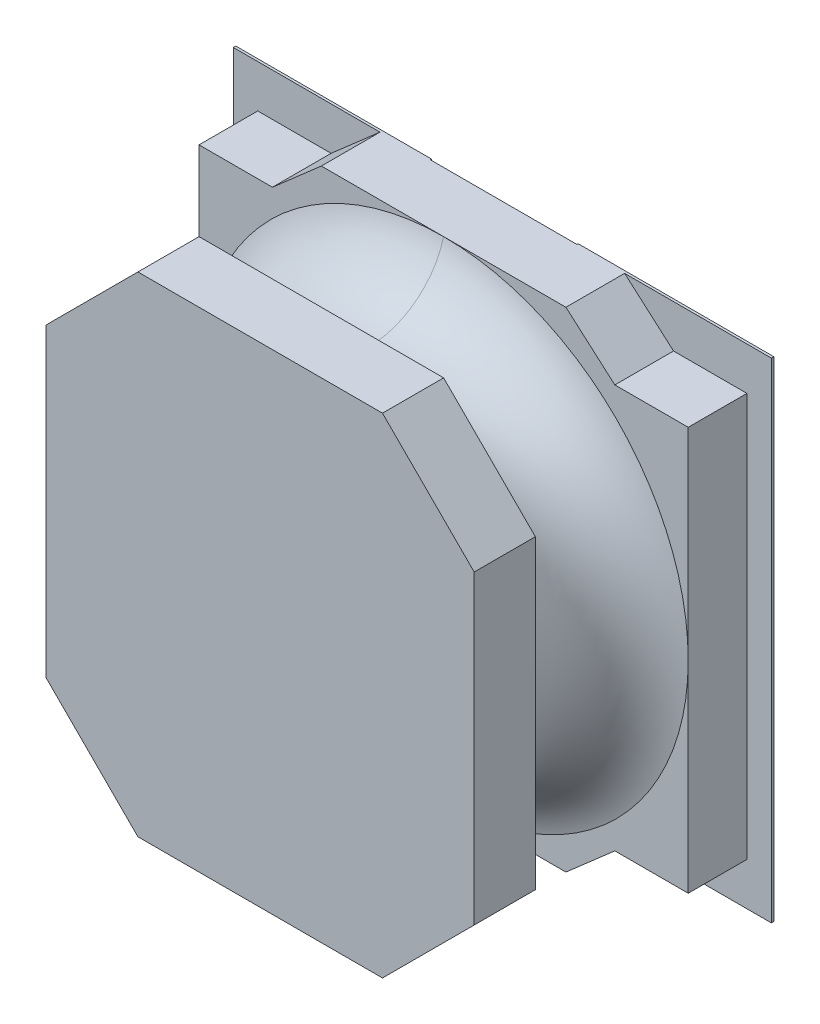
ISO-10303-21;
HEADER;
FILE_DESCRIPTION(('STEP AP214'),'2;1');
FILE_NAME('part.step','',(''),(''),'','','');
FILE_SCHEMA(('AUTOMOTIVE_DESIGN { 1 0 10303 214 1 1 1 1 }'));
ENDSEC;
DATA;
#1=APPLICATION_CONTEXT('core data for automotive mechanical design processes');
#2=APPLICATION_PROTOCOL_DEFINITION('international standard','automotive_design',2000,#1);
#3=PRODUCT_CONTEXT('',#1,'mechanical');
#4=PRODUCT('Part','Part','',(#3));
#5=PRODUCT_RELATED_PRODUCT_CATEGORY('part','',(#4));
#6=PRODUCT_DEFINITION_FORMATION('','',#4);
#7=PRODUCT_DEFINITION_CONTEXT('part definition',#1,'design');
#8=PRODUCT_DEFINITION('design','',#6,#7);
#9=PRODUCT_DEFINITION_SHAPE('','',#8);
#10=(LENGTH_UNIT() NAMED_UNIT(*) SI_UNIT(.MILLI.,.METRE.));
#11=(NAMED_UNIT(*) PLANE_ANGLE_UNIT() SI_UNIT($,.RADIAN.));
#12=(NAMED_UNIT(*) SI_UNIT($,.STERADIAN.) SOLID_ANGLE_UNIT());
#13=UNCERTAINTY_MEASURE_WITH_UNIT(LENGTH_MEASURE(1.E-05),#10,'distance_accuracy_value','');
#14=(GEOMETRIC_REPRESENTATION_CONTEXT(3) GLOBAL_UNCERTAINTY_ASSIGNED_CONTEXT((#13)) GLOBAL_UNIT_ASSIGNED_CONTEXT((#10,
#11,#12)) REPRESENTATION_CONTEXT('',''));
#15=CARTESIAN_POINT('',(0.,0.,0.));
#16=DIRECTION('',(0.,0.,1.));
#17=DIRECTION('',(1.,0.,0.));
#18=AXIS2_PLACEMENT_3D('',#15,#16,#17);
#19=CARTESIAN_POINT('',(-0.6,-2.,0.0762));
#20=DIRECTION('',(1.,0.,0.));
#21=DIRECTION('',(0.,1.,0.));
#22=AXIS2_PLACEMENT_3D('',#19,#20,#21);
#23=PLANE('',#22);
#24=DIRECTION('',(0.,1.,0.));
#25=VECTOR('',#24,1.);
#26=CARTESIAN_POINT('',(-0.6,-2.,0.0762));
#27=LINE('',#26,#25);
#28=CARTESIAN_POINT('',(-0.6,-2.,0.0762));
#29=VERTEX_POINT('',#28);
#30=CARTESIAN_POINT('',(-0.6,2.,0.0762));
#31=VERTEX_POINT('',#30);
#32=EDGE_CURVE('E28',#29,#31,#27,.T.);
#33=ORIENTED_EDGE('',*,*,#32,.T.);
#34=DIRECTION('',(0.,0.,1.));
#35=VECTOR('',#34,1.);
#36=CARTESIAN_POINT('',(-0.6,2.,0.0762));
#37=LINE('',#36,#35);
#38=CARTESIAN_POINT('',(-0.6,2.,0.0862));
#39=VERTEX_POINT('',#38);
#40=EDGE_CURVE('E404',#31,#39,#37,.T.);
#41=ORIENTED_EDGE('',*,*,#40,.T.);
#42=DIRECTION('',(0.,-1.,0.));
#43=VECTOR('',#42,1.);
#44=CARTESIAN_POINT('',(-0.6,2.,0.0862));
#45=LINE('',#44,#43);
#46=CARTESIAN_POINT('',(-0.6,-2.,0.0862));
#47=VERTEX_POINT('',#46);
#48=EDGE_CURVE('E322',#39,#47,#45,.T.);
#49=ORIENTED_EDGE('',*,*,#48,.T.);
#50=DIRECTION('',(0.,0.,1.));
#51=VECTOR('',#50,1.);
#52=CARTESIAN_POINT('',(-0.6,-2.,0.0762));
#53=LINE('',#52,#51);
#54=EDGE_CURVE('E358',#29,#47,#53,.T.);
#55=ORIENTED_EDGE('',*,*,#54,.F.);
#56=EDGE_LOOP('',(#33,#41,#49,#55));
#57=FACE_BOUND('',#56,.T.);
#58=ADVANCED_FACE('F17',(#57),#23,.T.);
#59=CARTESIAN_POINT('',(-2.2,2.,0.0762));
#60=DIRECTION('',(-1.,0.,0.));
#61=DIRECTION('',(0.,0.,1.));
#62=AXIS2_PLACEMENT_3D('',#59,#60,#61);
#63=PLANE('',#62);
#64=DIRECTION('',(0.,0.,1.));
#65=VECTOR('',#64,1.);
#66=CARTESIAN_POINT('',(-2.2,-2.,0.0762));
#67=LINE('',#66,#65);
#68=CARTESIAN_POINT('',(-2.2,-2.,0.0762));
#69=VERTEX_POINT('',#68);
#70=CARTESIAN_POINT('',(-2.2,-2.,0.0962));
#71=VERTEX_POINT('',#70);
#72=EDGE_CURVE('E374',#69,#71,#67,.T.);
#73=ORIENTED_EDGE('',*,*,#72,.T.);
#74=DIRECTION('',(0.,-1.,0.));
#75=VECTOR('',#74,1.);
#76=CARTESIAN_POINT('',(-2.2,2.,0.0962));
#77=LINE('',#76,#75);
#78=CARTESIAN_POINT('',(-2.2,2.,0.0962));
#79=VERTEX_POINT('',#78);
#80=EDGE_CURVE('E572',#79,#71,#77,.T.);
#81=ORIENTED_EDGE('',*,*,#80,.F.);
#82=DIRECTION('',(0.,0.,1.));
#83=VECTOR('',#82,1.);
#84=CARTESIAN_POINT('',(-2.2,2.,0.0762));
#85=LINE('',#84,#83);
#86=CARTESIAN_POINT('',(-2.2,2.,0.0762));
#87=VERTEX_POINT('',#86);
#88=EDGE_CURVE('E403',#87,#79,#85,.T.);
#89=ORIENTED_EDGE('',*,*,#88,.F.);
#90=DIRECTION('',(0.,-1.,0.));
#91=VECTOR('',#90,1.);
#92=CARTESIAN_POINT('',(-2.2,2.,0.0762));
#93=LINE('',#92,#91);
#94=EDGE_CURVE('E11',#87,#69,#93,.T.);
#95=ORIENTED_EDGE('',*,*,#94,.T.);
#96=EDGE_LOOP('',(#73,#81,#89,#95));
#97=FACE_BOUND('',#96,.T.);
#98=ADVANCED_FACE('F19',(#97),#63,.T.);
#99=CARTESIAN_POINT('',(0.,0.,0.0762));
#100=DIRECTION('',(0.,0.,1.));
#101=DIRECTION('',(1.,0.,0.));
#102=AXIS2_PLACEMENT_3D('',#99,#100,#101);
#103=PLANE('',#102);
#104=DIRECTION('',(-1.,0.,0.));
#105=VECTOR('',#104,1.);
#106=CARTESIAN_POINT('',(-0.6,2.,0.0762));
#107=LINE('',#106,#105);
#108=EDGE_CURVE('E399',#31,#87,#107,.T.);
#109=ORIENTED_EDGE('',*,*,#108,.F.);
#110=ORIENTED_EDGE('',*,*,#32,.F.);
#111=DIRECTION('',(1.,0.,0.));
#112=VECTOR('',#111,1.);
#113=CARTESIAN_POINT('',(-2.2,-2.,0.0762));
#114=LINE('',#113,#112);
#115=EDGE_CURVE('E366',#69,#29,#114,.T.);
#116=ORIENTED_EDGE('',*,*,#115,.F.);
#117=ORIENTED_EDGE('',*,*,#94,.F.);
#118=EDGE_LOOP('',(#109,#110,#116,#117));
#119=FACE_BOUND('',#118,.T.);
#120=ADVANCED_FACE('F1386',(#119),#103,.F.);
#121=CARTESIAN_POINT('',(0.,0.,0.0762));
#122=DIRECTION('',(0.,0.,1.));
#123=DIRECTION('',(1.,0.,0.));
#124=AXIS2_PLACEMENT_3D('',#121,#122,#123);
#125=PLANE('',#124);
#126=DIRECTION('',(0.,1.,0.));
#127=VECTOR('',#126,1.);
#128=CARTESIAN_POINT('',(2.2,-2.,0.0762));
#129=LINE('',#128,#127);
#130=CARTESIAN_POINT('',(2.2,-2.,0.0762));
#131=VERTEX_POINT('',#130);
#132=CARTESIAN_POINT('',(2.2,2.,0.0762));
#133=VERTEX_POINT('',#132);
#134=EDGE_CURVE('E456',#131,#133,#129,.T.);
#135=ORIENTED_EDGE('',*,*,#134,.F.);
#136=DIRECTION('',(1.,0.,0.));
#137=VECTOR('',#136,1.);
#138=CARTESIAN_POINT('',(0.6,-2.,0.0762));
#139=LINE('',#138,#137);
#140=CARTESIAN_POINT('',(0.6,-2.,0.0762));
#141=VERTEX_POINT('',#140);
#142=EDGE_CURVE('E348',#141,#131,#139,.T.);
#143=ORIENTED_EDGE('',*,*,#142,.F.);
#144=DIRECTION('',(0.,-1.,0.));
#145=VECTOR('',#144,1.);
#146=CARTESIAN_POINT('',(0.6,2.,0.0762));
#147=LINE('',#146,#145);
#148=CARTESIAN_POINT('',(0.6,2.,0.0762));
#149=VERTEX_POINT('',#148);
#150=EDGE_CURVE('E386',#149,#141,#147,.T.);
#151=ORIENTED_EDGE('',*,*,#150,.F.);
#152=DIRECTION('',(-1.,0.,0.));
#153=VECTOR('',#152,1.);
#154=CARTESIAN_POINT('',(2.2,2.,0.0762));
#155=LINE('',#154,#153);
#156=EDGE_CURVE('E343',#133,#149,#155,.T.);
#157=ORIENTED_EDGE('',*,*,#156,.F.);
#158=EDGE_LOOP('',(#135,#143,#151,#157));
#159=FACE_BOUND('',#158,.T.);
#160=ADVANCED_FACE('F1357',(#159),#125,.F.);
#161=CARTESIAN_POINT('',(2.2,-2.,0.0762));
#162=DIRECTION('',(1.,0.,0.));
#163=DIRECTION('',(0.,1.,0.));
#164=AXIS2_PLACEMENT_3D('',#161,#162,#163);
#165=PLANE('',#164);
#166=DIRECTION('',(0.,0.,1.));
#167=VECTOR('',#166,1.);
#168=CARTESIAN_POINT('',(2.2,2.,0.0762));
#169=LINE('',#168,#167);
#170=CARTESIAN_POINT('',(2.2,2.,0.0962));
#171=VERTEX_POINT('',#170);
#172=EDGE_CURVE('E266',#133,#171,#169,.T.);
#173=ORIENTED_EDGE('',*,*,#172,.T.);
#174=DIRECTION('',(0.,1.,0.));
#175=VECTOR('',#174,1.);
#176=CARTESIAN_POINT('',(2.2,-2.,0.0962));
#177=LINE('',#176,#175);
#178=CARTESIAN_POINT('',(2.2,-2.,0.0962));
#179=VERTEX_POINT('',#178);
#180=EDGE_CURVE('E305',#179,#171,#177,.T.);
#181=ORIENTED_EDGE('',*,*,#180,.F.);
#182=DIRECTION('',(0.,0.,1.));
#183=VECTOR('',#182,1.);
#184=CARTESIAN_POINT('',(2.2,-2.,0.0762));
#185=LINE('',#184,#183);
#186=EDGE_CURVE('E273',#131,#179,#185,.T.);
#187=ORIENTED_EDGE('',*,*,#186,.F.);
#188=ORIENTED_EDGE('',*,*,#134,.T.);
#189=EDGE_LOOP('',(#173,#181,#187,#188));
#190=FACE_BOUND('',#189,.T.);
#191=ADVANCED_FACE('F1351',(#190),#165,.T.);
#192=CARTESIAN_POINT('',(-1.4,-1.65,0.0762));
#193=DIRECTION('',(-0.658504607868497,-0.752576694706896,0.));
#194=DIRECTION('',(-0.752576694706896,0.658504607868497,0.));
#195=AXIS2_PLACEMENT_3D('',#192,#193,#194);
#196=PLANE('',#195);
#197=DIRECTION('',(0.,0.,1.));
#198=VECTOR('',#197,1.);
#199=CARTESIAN_POINT('',(-1.,-2.,0.0962));
#200=LINE('',#199,#198);
#201=CARTESIAN_POINT('',(-1.,-2.,0.0962));
#202=VERTEX_POINT('',#201);
#203=CARTESIAN_POINT('',(-1.,-2.,0.5762));
#204=VERTEX_POINT('',#203);
#205=EDGE_CURVE('E545',#202,#204,#200,.T.);
#206=ORIENTED_EDGE('',*,*,#205,.T.);
#207=DIRECTION('',(0.752576694706896,-0.658504607868497,0.));
#208=VECTOR('',#207,1.);
#209=CARTESIAN_POINT('',(-1.4,-1.65,0.5762));
#210=LINE('',#209,#208);
#211=CARTESIAN_POINT('',(-1.4,-1.65,0.5762));
#212=VERTEX_POINT('',#211);
#213=EDGE_CURVE('E307',#212,#204,#210,.T.);
#214=ORIENTED_EDGE('',*,*,#213,.F.);
#215=DIRECTION('',(0.,0.,1.));
#216=VECTOR('',#215,1.);
#217=CARTESIAN_POINT('',(-1.4,-1.65,0.0962));
#218=LINE('',#217,#216);
#219=CARTESIAN_POINT('',(-1.4,-1.65,0.0962));
#220=VERTEX_POINT('',#219);
#221=EDGE_CURVE('E452',#220,#212,#218,.T.);
#222=ORIENTED_EDGE('',*,*,#221,.F.);
#223=DIRECTION('',(0.752576694706896,-0.658504607868497,0.));
#224=VECTOR('',#223,1.);
#225=CARTESIAN_POINT('',(-1.4,-1.65,0.0962));
#226=LINE('',#225,#224);
#227=EDGE_CURVE('E438',#220,#202,#226,.T.);
#228=ORIENTED_EDGE('',*,*,#227,.T.);
#229=EDGE_LOOP('',(#206,#214,#222,#228));
#230=FACE_BOUND('',#229,.T.);
#231=ADVANCED_FACE('F1356',(#230),#196,.T.);
#232=CARTESIAN_POINT('',(-2.,-1.65,0.0762));
#233=DIRECTION('',(0.,-1.,0.));
#234=DIRECTION('',(0.,0.,-1.));
#235=AXIS2_PLACEMENT_3D('',#232,#233,#234);
#236=PLANE('',#235);
#237=ORIENTED_EDGE('',*,*,#221,.T.);
#238=DIRECTION('',(1.,0.,0.));
#239=VECTOR('',#238,1.);
#240=CARTESIAN_POINT('',(-2.,-1.65,0.5762));
#241=LINE('',#240,#239);
#242=CARTESIAN_POINT('',(-2.,-1.65,0.5762));
#243=VERTEX_POINT('',#242);
#244=EDGE_CURVE('E310',#243,#212,#241,.T.);
#245=ORIENTED_EDGE('',*,*,#244,.F.);
#246=DIRECTION('',(0.,0.,1.));
#247=VECTOR('',#246,1.);
#248=CARTESIAN_POINT('',(-2.,-1.65,0.0962));
#249=LINE('',#248,#247);
#250=CARTESIAN_POINT('',(-2.,-1.65,0.0962));
#251=VERTEX_POINT('',#250);
#252=EDGE_CURVE('E488',#251,#243,#249,.T.);
#253=ORIENTED_EDGE('',*,*,#252,.F.);
#254=DIRECTION('',(1.,0.,0.));
#255=VECTOR('',#254,1.);
#256=CARTESIAN_POINT('',(-2.,-1.65,0.0962));
#257=LINE('',#256,#255);
#258=EDGE_CURVE('E385',#251,#220,#257,.T.);
#259=ORIENTED_EDGE('',*,*,#258,.T.);
#260=EDGE_LOOP('',(#237,#245,#253,#259));
#261=FACE_BOUND('',#260,.T.);
#262=ADVANCED_FACE('F657',(#261),#236,.T.);
#263=CARTESIAN_POINT('',(-1.,2.,0.0762));
#264=DIRECTION('',(-0.658504607868497,0.752576694706896,0.));
#265=DIRECTION('',(0.,0.,1.));
#266=AXIS2_PLACEMENT_3D('',#263,#264,#265);
#267=PLANE('',#266);
#268=DIRECTION('',(0.,0.,1.));
#269=VECTOR('',#268,1.);
#270=CARTESIAN_POINT('',(-1.4,1.65,0.0962));
#271=LINE('',#270,#269);
#272=CARTESIAN_POINT('',(-1.4,1.65,0.0962));
#273=VERTEX_POINT('',#272);
#274=CARTESIAN_POINT('',(-1.4,1.65,0.5762));
#275=VERTEX_POINT('',#274);
#276=EDGE_CURVE('E457',#273,#275,#271,.T.);
#277=ORIENTED_EDGE('',*,*,#276,.T.);
#278=DIRECTION('',(-0.752576694706896,-0.658504607868497,0.));
#279=VECTOR('',#278,1.);
#280=CARTESIAN_POINT('',(-1.,2.,0.5762));
#281=LINE('',#280,#279);
#282=CARTESIAN_POINT('',(-1.,2.,0.5762));
#283=VERTEX_POINT('',#282);
#284=EDGE_CURVE('E498',#283,#275,#281,.T.);
#285=ORIENTED_EDGE('',*,*,#284,.F.);
#286=DIRECTION('',(0.,0.,1.));
#287=VECTOR('',#286,1.);
#288=CARTESIAN_POINT('',(-1.,2.,0.0962));
#289=LINE('',#288,#287);
#290=CARTESIAN_POINT('',(-1.,2.,0.0962));
#291=VERTEX_POINT('',#290);
#292=EDGE_CURVE('E445',#291,#283,#289,.T.);
#293=ORIENTED_EDGE('',*,*,#292,.F.);
#294=DIRECTION('',(-0.752576694706896,-0.658504607868497,0.));
#295=VECTOR('',#294,1.);
#296=CARTESIAN_POINT('',(-1.,2.,0.0962));
#297=LINE('',#296,#295);
#298=EDGE_CURVE('E332',#291,#273,#297,.T.);
#299=ORIENTED_EDGE('',*,*,#298,.T.);
#300=EDGE_LOOP('',(#277,#285,#293,#299));
#301=FACE_BOUND('',#300,.T.);
#302=ADVANCED_FACE('F650',(#301),#267,.T.);
#303=CARTESIAN_POINT('',(-1.4,1.65,0.0762));
#304=DIRECTION('',(0.,1.,0.));
#305=DIRECTION('',(1.,0.,0.));
#306=AXIS2_PLACEMENT_3D('',#303,#304,#305);
#307=PLANE('',#306);
#308=DIRECTION('',(0.,0.,1.));
#309=VECTOR('',#308,1.);
#310=CARTESIAN_POINT('',(-2.,1.65,0.0962));
#311=LINE('',#310,#309);
#312=CARTESIAN_POINT('',(-2.,1.65,0.0962));
#313=VERTEX_POINT('',#312);
#314=CARTESIAN_POINT('',(-2.,1.65,0.5762));
#315=VERTEX_POINT('',#314);
#316=EDGE_CURVE('E484',#313,#315,#311,.T.);
#317=ORIENTED_EDGE('',*,*,#316,.T.);
#318=DIRECTION('',(-1.,0.,0.));
#319=VECTOR('',#318,1.);
#320=CARTESIAN_POINT('',(-1.4,1.65,0.5762));
#321=LINE('',#320,#319);
#322=EDGE_CURVE('E261',#275,#315,#321,.T.);
#323=ORIENTED_EDGE('',*,*,#322,.F.);
#324=ORIENTED_EDGE('',*,*,#276,.F.);
#325=DIRECTION('',(-1.,0.,0.));
#326=VECTOR('',#325,1.);
#327=CARTESIAN_POINT('',(-1.4,1.65,0.0962));
#328=LINE('',#327,#326);
#329=EDGE_CURVE('E336',#273,#313,#328,.T.);
#330=ORIENTED_EDGE('',*,*,#329,.T.);
#331=EDGE_LOOP('',(#317,#323,#324,#330));
#332=FACE_BOUND('',#331,.T.);
#333=ADVANCED_FACE('F612',(#332),#307,.T.);
#334=CARTESIAN_POINT('',(-2.,1.65,0.0762));
#335=DIRECTION('',(-1.,0.,0.));
#336=DIRECTION('',(0.,0.,1.));
#337=AXIS2_PLACEMENT_3D('',#334,#335,#336);
#338=PLANE('',#337);
#339=ORIENTED_EDGE('',*,*,#252,.T.);
#340=DIRECTION('',(0.,-1.,0.));
#341=VECTOR('',#340,1.);
#342=CARTESIAN_POINT('',(-2.,0.,0.5762));
#343=LINE('',#342,#341);
#344=CARTESIAN_POINT('',(-2.,0.,0.5762));
#345=VERTEX_POINT('',#344);
#346=EDGE_CURVE('E324',#345,#243,#343,.T.);
#347=ORIENTED_EDGE('',*,*,#346,.F.);
#348=DIRECTION('',(0.,-1.,0.));
#349=VECTOR('',#348,1.);
#350=CARTESIAN_POINT('',(-2.,1.65,0.5762));
#351=LINE('',#350,#349);
#352=EDGE_CURVE('E396',#315,#345,#351,.T.);
#353=ORIENTED_EDGE('',*,*,#352,.F.);
#354=ORIENTED_EDGE('',*,*,#316,.F.);
#355=DIRECTION('',(0.,-1.,0.));
#356=VECTOR('',#355,1.);
#357=CARTESIAN_POINT('',(-2.,1.65,0.0962));
#358=LINE('',#357,#356);
#359=EDGE_CURVE('E381',#313,#251,#358,.T.);
#360=ORIENTED_EDGE('',*,*,#359,.T.);
#361=EDGE_LOOP('',(#339,#347,#353,#354,#360));
#362=FACE_BOUND('',#361,.T.);
#363=ADVANCED_FACE('F616',(#362),#338,.T.);
#364=CARTESIAN_POINT('',(1.4,1.65,0.0762));
#365=DIRECTION('',(0.658504607868497,0.752576694706896,0.));
#366=DIRECTION('',(0.,0.,-1.));
#367=AXIS2_PLACEMENT_3D('',#364,#365,#366);
#368=PLANE('',#367);
#369=DIRECTION('',(0.,0.,1.));
#370=VECTOR('',#369,1.);
#371=CARTESIAN_POINT('',(1.,2.,0.0962));
#372=LINE('',#371,#370);
#373=CARTESIAN_POINT('',(1.,2.,0.0962));
#374=VERTEX_POINT('',#373);
#375=CARTESIAN_POINT('',(1.,2.,0.5762));
#376=VERTEX_POINT('',#375);
#377=EDGE_CURVE('E263',#374,#376,#372,.T.);
#378=ORIENTED_EDGE('',*,*,#377,.T.);
#379=DIRECTION('',(-0.752576694706896,0.658504607868497,0.));
#380=VECTOR('',#379,1.);
#381=CARTESIAN_POINT('',(1.4,1.65,0.5762));
#382=LINE('',#381,#380);
#383=CARTESIAN_POINT('',(1.4,1.65,0.5762));
#384=VERTEX_POINT('',#383);
#385=EDGE_CURVE('E342',#384,#376,#382,.T.);
#386=ORIENTED_EDGE('',*,*,#385,.F.);
#387=DIRECTION('',(0.,0.,1.));
#388=VECTOR('',#387,1.);
#389=CARTESIAN_POINT('',(1.4,1.65,0.0962));
#390=LINE('',#389,#388);
#391=CARTESIAN_POINT('',(1.4,1.65,0.0962));
#392=VERTEX_POINT('',#391);
#393=EDGE_CURVE('E497',#392,#384,#390,.T.);
#394=ORIENTED_EDGE('',*,*,#393,.F.);
#395=DIRECTION('',(-0.752576694706896,0.658504607868497,0.));
#396=VECTOR('',#395,1.);
#397=CARTESIAN_POINT('',(1.4,1.65,0.0962));
#398=LINE('',#397,#396);
#399=EDGE_CURVE('E408',#392,#374,#398,.T.);
#400=ORIENTED_EDGE('',*,*,#399,.T.);
#401=EDGE_LOOP('',(#378,#386,#394,#400));
#402=FACE_BOUND('',#401,.T.);
#403=ADVANCED_FACE('F524',(#402),#368,.T.);
#404=CARTESIAN_POINT('',(0.,0.,2.0762));
#405=DIRECTION('',(0.,0.,1.));
#406=DIRECTION('',(1.,0.,0.));
#407=AXIS2_PLACEMENT_3D('',#404,#405,#406);
#408=PLANE('',#407);
#409=DIRECTION('',(1.,0.,0.));
#410=VECTOR('',#409,1.);
#411=CARTESIAN_POINT('',(-1.,2.,2.0762));
#412=LINE('',#411,#410);
#413=CARTESIAN_POINT('',(-1.,2.,2.0762));
#414=VERTEX_POINT('',#413);
#415=CARTESIAN_POINT('',(1.,2.,2.0762));
#416=VERTEX_POINT('',#415);
#417=EDGE_CURVE('E42',#414,#416,#412,.T.);
#418=ORIENTED_EDGE('',*,*,#417,.F.);
#419=DIRECTION('',(0.707106781186548,0.707106781186548,0.));
#420=VECTOR('',#419,1.);
#421=CARTESIAN_POINT('',(-1.75,1.25,2.0762));
#422=LINE('',#421,#420);
#423=CARTESIAN_POINT('',(-1.75,1.25,2.0762));
#424=VERTEX_POINT('',#423);
#425=EDGE_CURVE('E317',#424,#414,#422,.T.);
#426=ORIENTED_EDGE('',*,*,#425,.F.);
#427=DIRECTION('',(0.,1.,0.));
#428=VECTOR('',#427,1.);
#429=CARTESIAN_POINT('',(-1.75,-1.25,2.0762));
#430=LINE('',#429,#428);
#431=CARTESIAN_POINT('',(-1.75,-1.25,2.0762));
#432=VERTEX_POINT('',#431);
#433=EDGE_CURVE('E230',#432,#424,#430,.T.);
#434=ORIENTED_EDGE('',*,*,#433,.F.);
#435=DIRECTION('',(-0.707106781186548,0.707106781186548,0.));
#436=VECTOR('',#435,1.);
#437=CARTESIAN_POINT('',(-1.,-2.,2.0762));
#438=LINE('',#437,#436);
#439=CARTESIAN_POINT('',(-1.,-2.,2.0762));
#440=VERTEX_POINT('',#439);
#441=EDGE_CURVE('E223',#440,#432,#438,.T.);
#442=ORIENTED_EDGE('',*,*,#441,.F.);
#443=DIRECTION('',(-1.,0.,0.));
#444=VECTOR('',#443,1.);
#445=CARTESIAN_POINT('',(1.,-2.,2.0762));
#446=LINE('',#445,#444);
#447=CARTESIAN_POINT('',(1.,-2.,2.0762));
#448=VERTEX_POINT('',#447);
#449=EDGE_CURVE('E227',#448,#440,#446,.T.);
#450=ORIENTED_EDGE('',*,*,#449,.F.);
#451=DIRECTION('',(-0.707106781186548,-0.707106781186548,0.));
#452=VECTOR('',#451,1.);
#453=CARTESIAN_POINT('',(1.75,-1.25,2.0762));
#454=LINE('',#453,#452);
#455=CARTESIAN_POINT('',(1.75,-1.25,2.0762));
#456=VERTEX_POINT('',#455);
#457=EDGE_CURVE('E257',#456,#448,#454,.T.);
#458=ORIENTED_EDGE('',*,*,#457,.F.);
#459=DIRECTION('',(0.,-1.,0.));
#460=VECTOR('',#459,1.);
#461=CARTESIAN_POINT('',(1.75,1.25,2.0762));
#462=LINE('',#461,#460);
#463=CARTESIAN_POINT('',(1.75,1.25,2.0762));
#464=VERTEX_POINT('',#463);
#465=EDGE_CURVE('E300',#464,#456,#462,.T.);
#466=ORIENTED_EDGE('',*,*,#465,.F.);
#467=DIRECTION('',(0.707106781186548,-0.707106781186548,0.));
#468=VECTOR('',#467,1.);
#469=CARTESIAN_POINT('',(1.,2.,2.0762));
#470=LINE('',#469,#468);
#471=EDGE_CURVE('E285',#416,#464,#470,.T.);
#472=ORIENTED_EDGE('',*,*,#471,.F.);
#473=EDGE_LOOP('',(#418,#426,#434,#442,#450,#458,#466,#472));
#474=FACE_BOUND('',#473,.T.);
#475=ADVANCED_FACE('F225',(#474),#408,.T.);
#476=CARTESIAN_POINT('',(1.,2.,1.5762));
#477=DIRECTION('',(0.,1.,0.));
#478=DIRECTION('',(1.,0.,0.));
#479=AXIS2_PLACEMENT_3D('',#476,#477,#478);
#480=PLANE('',#479);
#481=DIRECTION('',(0.,0.,-1.));
#482=VECTOR('',#481,1.);
#483=CARTESIAN_POINT('',(-1.,2.,2.0762));
#484=LINE('',#483,#482);
#485=CARTESIAN_POINT('',(-1.,2.,1.5762));
#486=VERTEX_POINT('',#485);
#487=EDGE_CURVE('E471',#414,#486,#484,.T.);
#488=ORIENTED_EDGE('',*,*,#487,.F.);
#489=ORIENTED_EDGE('',*,*,#417,.T.);
#490=DIRECTION('',(0.,0.,-1.));
#491=VECTOR('',#490,1.);
#492=CARTESIAN_POINT('',(1.,2.,2.0762));
#493=LINE('',#492,#491);
#494=CARTESIAN_POINT('',(1.,2.,1.5762));
#495=VERTEX_POINT('',#494);
#496=EDGE_CURVE('E290',#416,#495,#493,.T.);
#497=ORIENTED_EDGE('',*,*,#496,.T.);
#498=DIRECTION('',(1.,0.,0.));
#499=VECTOR('',#498,1.);
#500=CARTESIAN_POINT('',(-1.,2.,1.5762));
#501=LINE('',#500,#499);
#502=EDGE_CURVE('E426',#486,#495,#501,.T.);
#503=ORIENTED_EDGE('',*,*,#502,.F.);
#504=EDGE_LOOP('',(#488,#489,#497,#503));
#505=FACE_BOUND('',#504,.T.);
#506=ADVANCED_FACE('F1397',(#505),#480,.T.);
#507=CARTESIAN_POINT('',(-1.,2.,1.5762));
#508=DIRECTION('',(-0.707106781186548,0.707106781186548,0.));
#509=DIRECTION('',(0.,0.,1.));
#510=AXIS2_PLACEMENT_3D('',#507,#508,#509);
#511=PLANE('',#510);
#512=DIRECTION('',(0.,0.,-1.));
#513=VECTOR('',#512,1.);
#514=CARTESIAN_POINT('',(-1.75,1.25,2.0762));
#515=LINE('',#514,#513);
#516=CARTESIAN_POINT('',(-1.75,1.25,1.5762));
#517=VERTEX_POINT('',#516);
#518=EDGE_CURVE('E314',#424,#517,#515,.T.);
#519=ORIENTED_EDGE('',*,*,#518,.F.);
#520=ORIENTED_EDGE('',*,*,#425,.T.);
#521=ORIENTED_EDGE('',*,*,#487,.T.);
#522=DIRECTION('',(0.707106781186548,0.707106781186548,0.));
#523=VECTOR('',#522,1.);
#524=CARTESIAN_POINT('',(-1.75,1.25,1.5762));
#525=LINE('',#524,#523);
#526=EDGE_CURVE('E431',#517,#486,#525,.T.);
#527=ORIENTED_EDGE('',*,*,#526,.F.);
#528=EDGE_LOOP('',(#519,#520,#521,#527));
#529=FACE_BOUND('',#528,.T.);
#530=ADVANCED_FACE('F1495',(#529),#511,.T.);
#531=CARTESIAN_POINT('',(-1.75,1.25,1.5762));
#532=DIRECTION('',(-1.,0.,0.));
#533=DIRECTION('',(0.,0.,1.));
#534=AXIS2_PLACEMENT_3D('',#531,#532,#533);
#535=PLANE('',#534);
#536=DIRECTION('',(0.,0.,-1.));
#537=VECTOR('',#536,1.);
#538=CARTESIAN_POINT('',(-1.75,-1.25,2.0762));
#539=LINE('',#538,#537);
#540=CARTESIAN_POINT('',(-1.75,-1.25,1.5762));
#541=VERTEX_POINT('',#540);
#542=EDGE_CURVE('E234',#432,#541,#539,.T.);
#543=ORIENTED_EDGE('',*,*,#542,.F.);
#544=ORIENTED_EDGE('',*,*,#433,.T.);
#545=ORIENTED_EDGE('',*,*,#518,.T.);
#546=DIRECTION('',(0.,1.,0.));
#547=VECTOR('',#546,1.);
#548=CARTESIAN_POINT('',(-1.75,-1.25,1.5762));
#549=LINE('',#548,#547);
#550=EDGE_CURVE('E463',#541,#517,#549,.T.);
#551=ORIENTED_EDGE('',*,*,#550,.F.);
#552=EDGE_LOOP('',(#543,#544,#545,#551));
#553=FACE_BOUND('',#552,.T.);
#554=ADVANCED_FACE('F1505',(#553),#535,.T.);
#555=CARTESIAN_POINT('',(-1.75,-1.25,1.5762));
#556=DIRECTION('',(-0.707106781186548,-0.707106781186548,0.));
#557=DIRECTION('',(-0.707106781186548,0.707106781186548,0.));
#558=AXIS2_PLACEMENT_3D('',#555,#556,#557);
#559=PLANE('',#558);
#560=DIRECTION('',(0.,0.,-1.));
#561=VECTOR('',#560,1.);
#562=CARTESIAN_POINT('',(-1.,-2.,2.0762));
#563=LINE('',#562,#561);
#564=CARTESIAN_POINT('',(-1.,-2.,1.5762));
#565=VERTEX_POINT('',#564);
#566=EDGE_CURVE('E235',#440,#565,#563,.T.);
#567=ORIENTED_EDGE('',*,*,#566,.F.);
#568=ORIENTED_EDGE('',*,*,#441,.T.);
#569=ORIENTED_EDGE('',*,*,#542,.T.);
#570=DIRECTION('',(-0.707106781186548,0.707106781186548,0.));
#571=VECTOR('',#570,1.);
#572=CARTESIAN_POINT('',(-1.,-2.,1.5762));
#573=LINE('',#572,#571);
#574=EDGE_CURVE('E240',#565,#541,#573,.T.);
#575=ORIENTED_EDGE('',*,*,#574,.F.);
#576=EDGE_LOOP('',(#567,#568,#569,#575));
#577=FACE_BOUND('',#576,.T.);
#578=ADVANCED_FACE('F238',(#577),#559,.T.);
#579=CARTESIAN_POINT('',(-1.,-2.,1.5762));
#580=DIRECTION('',(0.,-1.,0.));
#581=DIRECTION('',(0.,0.,-1.));
#582=AXIS2_PLACEMENT_3D('',#579,#580,#581);
#583=PLANE('',#582);
#584=DIRECTION('',(0.,0.,-1.));
#585=VECTOR('',#584,1.);
#586=CARTESIAN_POINT('',(1.,-2.,2.0762));
#587=LINE('',#586,#585);
#588=CARTESIAN_POINT('',(1.,-2.,1.5762));
#589=VERTEX_POINT('',#588);
#590=EDGE_CURVE('E247',#448,#589,#587,.T.);
#591=ORIENTED_EDGE('',*,*,#590,.F.);
#592=ORIENTED_EDGE('',*,*,#449,.T.);
#593=ORIENTED_EDGE('',*,*,#566,.T.);
#594=DIRECTION('',(-1.,0.,0.));
#595=VECTOR('',#594,1.);
#596=CARTESIAN_POINT('',(1.,-2.,1.5762));
#597=LINE('',#596,#595);
#598=EDGE_CURVE('E424',#589,#565,#597,.T.);
#599=ORIENTED_EDGE('',*,*,#598,.F.);
#600=EDGE_LOOP('',(#591,#592,#593,#599));
#601=FACE_BOUND('',#600,.T.);
#602=ADVANCED_FACE('F246',(#601),#583,.T.);
#603=CARTESIAN_POINT('',(1.,-2.,1.5762));
#604=DIRECTION('',(0.707106781186548,-0.707106781186548,0.));
#605=DIRECTION('',(0.,0.,-1.));
#606=AXIS2_PLACEMENT_3D('',#603,#604,#605);
#607=PLANE('',#606);
#608=DIRECTION('',(0.,0.,-1.));
#609=VECTOR('',#608,1.);
#610=CARTESIAN_POINT('',(1.75,-1.25,2.0762));
#611=LINE('',#610,#609);
#612=CARTESIAN_POINT('',(1.75,-1.25,1.5762));
#613=VERTEX_POINT('',#612);
#614=EDGE_CURVE('E296',#456,#613,#611,.T.);
#615=ORIENTED_EDGE('',*,*,#614,.F.);
#616=ORIENTED_EDGE('',*,*,#457,.T.);
#617=ORIENTED_EDGE('',*,*,#590,.T.);
#618=DIRECTION('',(-0.707106781186548,-0.707106781186548,0.));
#619=VECTOR('',#618,1.);
#620=CARTESIAN_POINT('',(1.75,-1.25,1.5762));
#621=LINE('',#620,#619);
#622=EDGE_CURVE('E420',#613,#589,#621,.T.);
#623=ORIENTED_EDGE('',*,*,#622,.F.);
#624=EDGE_LOOP('',(#615,#616,#617,#623));
#625=FACE_BOUND('',#624,.T.);
#626=ADVANCED_FACE('F1532',(#625),#607,.T.);
#627=CARTESIAN_POINT('',(1.75,-1.25,1.5762));
#628=DIRECTION('',(1.,0.,0.));
#629=DIRECTION('',(0.,1.,0.));
#630=AXIS2_PLACEMENT_3D('',#627,#628,#629);
#631=PLANE('',#630);
#632=DIRECTION('',(0.,0.,-1.));
#633=VECTOR('',#632,1.);
#634=CARTESIAN_POINT('',(1.75,1.25,2.0762));
#635=LINE('',#634,#633);
#636=CARTESIAN_POINT('',(1.75,1.25,1.5762));
#637=VERTEX_POINT('',#636);
#638=EDGE_CURVE('E289',#464,#637,#635,.T.);
#639=ORIENTED_EDGE('',*,*,#638,.F.);
#640=ORIENTED_EDGE('',*,*,#465,.T.);
#641=ORIENTED_EDGE('',*,*,#614,.T.);
#642=DIRECTION('',(0.,-1.,0.));
#643=VECTOR('',#642,1.);
#644=CARTESIAN_POINT('',(1.75,1.25,1.5762));
#645=LINE('',#644,#643);
#646=EDGE_CURVE('E425',#637,#613,#645,.T.);
#647=ORIENTED_EDGE('',*,*,#646,.F.);
#648=EDGE_LOOP('',(#639,#640,#641,#647));
#649=FACE_BOUND('',#648,.T.);
#650=ADVANCED_FACE('F1540',(#649),#631,.T.);
#651=CARTESIAN_POINT('',(1.75,1.25,1.5762));
#652=DIRECTION('',(0.707106781186548,0.707106781186548,0.));
#653=DIRECTION('',(0.,0.,-1.));
#654=AXIS2_PLACEMENT_3D('',#651,#652,#653);
#655=PLANE('',#654);
#656=ORIENTED_EDGE('',*,*,#496,.F.);
#657=ORIENTED_EDGE('',*,*,#471,.T.);
#658=ORIENTED_EDGE('',*,*,#638,.T.);
#659=DIRECTION('',(0.707106781186548,-0.707106781186548,0.));
#660=VECTOR('',#659,1.);
#661=CARTESIAN_POINT('',(1.,2.,1.5762));
#662=LINE('',#661,#660);
#663=EDGE_CURVE('E430',#495,#637,#662,.T.);
#664=ORIENTED_EDGE('',*,*,#663,.F.);
#665=EDGE_LOOP('',(#656,#657,#658,#664));
#666=FACE_BOUND('',#665,.T.);
#667=ADVANCED_FACE('F1549',(#666),#655,.T.);
#668=CARTESIAN_POINT('',(0.,0.,1.5762));
#669=DIRECTION('',(0.,0.,1.));
#670=DIRECTION('',(1.,0.,0.));
#671=AXIS2_PLACEMENT_3D('',#668,#669,#670);
#672=PLANE('',#671);
#673=CARTESIAN_POINT('',(0.,0.,1.5762));
#674=DIRECTION('',(0.,0.,1.));
#675=DIRECTION('',(0.,1.,0.));
#676=AXIS2_PLACEMENT_3D('',#673,#674,#675);
#677=CIRCLE('',#676,1.65);
#678=CARTESIAN_POINT('',(0.,1.65,1.5762));
#679=VERTEX_POINT('',#678);
#680=CARTESIAN_POINT('',(0.,-1.65,1.5762));
#681=VERTEX_POINT('',#680);
#682=EDGE_CURVE('E294',#679,#681,#677,.T.);
#683=ORIENTED_EDGE('',*,*,#682,.T.);
#684=CARTESIAN_POINT('',(0.,0.,1.5762));
#685=DIRECTION('',(0.,0.,1.));
#686=DIRECTION('',(0.,-1.,0.));
#687=AXIS2_PLACEMENT_3D('',#684,#685,#686);
#688=CIRCLE('',#687,1.65);
#689=EDGE_CURVE('E295',#681,#679,#688,.T.);
#690=ORIENTED_EDGE('',*,*,#689,.T.);
#691=EDGE_LOOP('',(#683,#690));
#692=FACE_BOUND('',#691,.T.);
#693=ORIENTED_EDGE('',*,*,#646,.T.);
#694=ORIENTED_EDGE('',*,*,#622,.T.);
#695=ORIENTED_EDGE('',*,*,#598,.T.);
#696=ORIENTED_EDGE('',*,*,#574,.T.);
#697=ORIENTED_EDGE('',*,*,#550,.T.);
#698=ORIENTED_EDGE('',*,*,#526,.T.);
#699=ORIENTED_EDGE('',*,*,#502,.T.);
#700=ORIENTED_EDGE('',*,*,#663,.T.);
#701=EDGE_LOOP('',(#693,#694,#695,#696,#697,#698,#699,#700));
#702=FACE_BOUND('',#701,.T.);
#703=ADVANCED_FACE('F1560',(#692,#702),#672,.F.);
#704=CARTESIAN_POINT('',(0.,0.,1.194866067147));
#705=DIRECTION('',(0.,0.,1.));
#706=DIRECTION('',(0.,1.,0.));
#707=AXIS2_PLACEMENT_3D('',#704,#705,#706);
#708=TOROIDAL_SURFACE('',#707,2.164045906133,0.6400459061329);
#709=ORIENTED_EDGE('',*,*,#682,.F.);
#710=CARTESIAN_POINT('',(0.,2.164045906133,1.194866067147));
#711=DIRECTION('',(1.,0.,0.));
#712=DIRECTION('',(0.,-0.803139120502681,0.595791534950086));
#713=AXIS2_PLACEMENT_3D('',#710,#711,#712);
#714=CIRCLE('',#713,0.6400459061329);
#715=CARTESIAN_POINT('',(0.,2.,0.5762));
#716=VERTEX_POINT('',#715);
#717=EDGE_CURVE('E284',#679,#716,#714,.T.);
#718=ORIENTED_EDGE('',*,*,#717,.T.);
#719=CARTESIAN_POINT('',(0.,0.,0.5762));
#720=DIRECTION('',(0.,0.,-1.));
#721=DIRECTION('',(-1.,0.,0.));
#722=AXIS2_PLACEMENT_3D('',#719,#720,#721);
#723=CIRCLE('',#722,2.);
#724=EDGE_CURVE('E392',#345,#716,#723,.T.);
#725=ORIENTED_EDGE('',*,*,#724,.F.);
#726=CARTESIAN_POINT('',(0.,0.,0.5762));
#727=DIRECTION('',(0.,0.,-1.));
#728=DIRECTION('',(0.,-1.,0.));
#729=AXIS2_PLACEMENT_3D('',#726,#727,#728);
#730=CIRCLE('',#729,2.);
#731=CARTESIAN_POINT('',(0.,-2.,0.5762));
#732=VERTEX_POINT('',#731);
#733=EDGE_CURVE('E309',#732,#345,#730,.T.);
#734=ORIENTED_EDGE('',*,*,#733,.F.);
#735=CARTESIAN_POINT('',(0.,-2.164045906133,1.194866067147));
#736=DIRECTION('',(-1.,0.,0.));
#737=DIRECTION('',(0.,0.803139120502681,0.595791534950086));
#738=AXIS2_PLACEMENT_3D('',#735,#736,#737);
#739=CIRCLE('',#738,0.6400459061329);
#740=EDGE_CURVE('E291',#681,#732,#739,.T.);
#741=ORIENTED_EDGE('',*,*,#740,.F.);
#742=EDGE_LOOP('',(#709,#718,#725,#734,#741));
#743=FACE_BOUND('',#742,.T.);
#744=ADVANCED_FACE('F628',(#743),#708,.F.);
#745=CARTESIAN_POINT('',(0.,0.,1.194866067147));
#746=DIRECTION('',(0.,0.,1.));
#747=DIRECTION('',(0.,1.,0.));
#748=AXIS2_PLACEMENT_3D('',#745,#746,#747);
#749=TOROIDAL_SURFACE('',#748,2.164045906133,0.6400459061329);
#750=CARTESIAN_POINT('',(0.,0.,0.5762));
#751=DIRECTION('',(0.,0.,1.));
#752=DIRECTION('',(0.,-1.,0.));
#753=AXIS2_PLACEMENT_3D('',#750,#751,#752);
#754=CIRCLE('',#753,2.);
#755=CARTESIAN_POINT('',(2.,0.,0.5762));
#756=VERTEX_POINT('',#755);
#757=EDGE_CURVE('E278',#732,#756,#754,.T.);
#758=ORIENTED_EDGE('',*,*,#757,.T.);
#759=CARTESIAN_POINT('',(0.,0.,0.5762));
#760=DIRECTION('',(0.,0.,1.));
#761=DIRECTION('',(1.,0.,0.));
#762=AXIS2_PLACEMENT_3D('',#759,#760,#761);
#763=CIRCLE('',#762,2.);
#764=EDGE_CURVE('E337',#756,#716,#763,.T.);
#765=ORIENTED_EDGE('',*,*,#764,.T.);
#766=ORIENTED_EDGE('',*,*,#717,.F.);
#767=ORIENTED_EDGE('',*,*,#689,.F.);
#768=ORIENTED_EDGE('',*,*,#740,.T.);
#769=EDGE_LOOP('',(#758,#765,#766,#767,#768));
#770=FACE_BOUND('',#769,.T.);
#771=ADVANCED_FACE('F636',(#770),#749,.F.);
#772=CARTESIAN_POINT('',(1.4,-1.65,0.0762));
#773=DIRECTION('',(0.,-1.,0.));
#774=DIRECTION('',(0.,0.,-1.));
#775=AXIS2_PLACEMENT_3D('',#772,#773,#774);
#776=PLANE('',#775);
#777=DIRECTION('',(0.,0.,1.));
#778=VECTOR('',#777,1.);
#779=CARTESIAN_POINT('',(2.,-1.65,0.0962));
#780=LINE('',#779,#778);
#781=CARTESIAN_POINT('',(2.,-1.65,0.0962));
#782=VERTEX_POINT('',#781);
#783=CARTESIAN_POINT('',(2.,-1.65,0.5762));
#784=VERTEX_POINT('',#783);
#785=EDGE_CURVE('E280',#782,#784,#780,.T.);
#786=ORIENTED_EDGE('',*,*,#785,.T.);
#787=DIRECTION('',(1.,0.,0.));
#788=VECTOR('',#787,1.);
#789=CARTESIAN_POINT('',(1.4,-1.65,0.5762));
#790=LINE('',#789,#788);
#791=CARTESIAN_POINT('',(1.4,-1.65,0.5762));
#792=VERTEX_POINT('',#791);
#793=EDGE_CURVE('E279',#792,#784,#790,.T.);
#794=ORIENTED_EDGE('',*,*,#793,.F.);
#795=DIRECTION('',(0.,0.,1.));
#796=VECTOR('',#795,1.);
#797=CARTESIAN_POINT('',(1.4,-1.65,0.0962));
#798=LINE('',#797,#796);
#799=CARTESIAN_POINT('',(1.4,-1.65,0.0962));
#800=VERTEX_POINT('',#799);
#801=EDGE_CURVE('E272',#800,#792,#798,.T.);
#802=ORIENTED_EDGE('',*,*,#801,.F.);
#803=DIRECTION('',(1.,0.,0.));
#804=VECTOR('',#803,1.);
#805=CARTESIAN_POINT('',(1.4,-1.65,0.0962));
#806=LINE('',#805,#804);
#807=EDGE_CURVE('E331',#800,#782,#806,.T.);
#808=ORIENTED_EDGE('',*,*,#807,.T.);
#809=EDGE_LOOP('',(#786,#794,#802,#808));
#810=FACE_BOUND('',#809,.T.);
#811=ADVANCED_FACE('F1585',(#810),#776,.T.);
#812=CARTESIAN_POINT('',(2.,-1.65,0.0762));
#813=DIRECTION('',(1.,0.,0.));
#814=DIRECTION('',(0.,1.,0.));
#815=AXIS2_PLACEMENT_3D('',#812,#813,#814);
#816=PLANE('',#815);
#817=DIRECTION('',(0.,0.,1.));
#818=VECTOR('',#817,1.);
#819=CARTESIAN_POINT('',(2.,1.65,0.0962));
#820=LINE('',#819,#818);
#821=CARTESIAN_POINT('',(2.,1.65,0.0962));
#822=VERTEX_POINT('',#821);
#823=CARTESIAN_POINT('',(2.,1.65,0.5762));
#824=VERTEX_POINT('',#823);
#825=EDGE_CURVE('E467',#822,#824,#820,.T.);
#826=ORIENTED_EDGE('',*,*,#825,.T.);
#827=DIRECTION('',(0.,1.,0.));
#828=VECTOR('',#827,1.);
#829=CARTESIAN_POINT('',(2.,0.,0.5762));
#830=LINE('',#829,#828);
#831=EDGE_CURVE('E341',#756,#824,#830,.T.);
#832=ORIENTED_EDGE('',*,*,#831,.F.);
#833=DIRECTION('',(0.,1.,0.));
#834=VECTOR('',#833,1.);
#835=CARTESIAN_POINT('',(2.,-1.65,0.5762));
#836=LINE('',#835,#834);
#837=EDGE_CURVE('E274',#784,#756,#836,.T.);
#838=ORIENTED_EDGE('',*,*,#837,.F.);
#839=ORIENTED_EDGE('',*,*,#785,.F.);
#840=DIRECTION('',(0.,1.,0.));
#841=VECTOR('',#840,1.);
#842=CARTESIAN_POINT('',(2.,-1.65,0.0962));
#843=LINE('',#842,#841);
#844=EDGE_CURVE('E405',#782,#822,#843,.T.);
#845=ORIENTED_EDGE('',*,*,#844,.T.);
#846=EDGE_LOOP('',(#826,#832,#838,#839,#845));
#847=FACE_BOUND('',#846,.T.);
#848=ADVANCED_FACE('F1593',(#847),#816,.T.);
#849=CARTESIAN_POINT('',(0.,0.,0.5762));
#850=DIRECTION('',(0.,0.,1.));
#851=DIRECTION('',(1.,0.,0.));
#852=AXIS2_PLACEMENT_3D('',#849,#850,#851);
#853=PLANE('',#852);
#854=DIRECTION('',(0.752576694706896,0.658504607868497,0.));
#855=VECTOR('',#854,1.);
#856=CARTESIAN_POINT('',(1.,-2.,0.5762));
#857=LINE('',#856,#855);
#858=CARTESIAN_POINT('',(1.,-2.,0.5762));
#859=VERTEX_POINT('',#858);
#860=EDGE_CURVE('E380',#859,#792,#857,.T.);
#861=ORIENTED_EDGE('',*,*,#860,.T.);
#862=ORIENTED_EDGE('',*,*,#793,.T.);
#863=ORIENTED_EDGE('',*,*,#837,.T.);
#864=ORIENTED_EDGE('',*,*,#757,.F.);
#865=DIRECTION('',(1.,0.,0.));
#866=VECTOR('',#865,1.);
#867=CARTESIAN_POINT('',(0.,-2.,0.5762));
#868=LINE('',#867,#866);
#869=EDGE_CURVE('E412',#732,#859,#868,.T.);
#870=ORIENTED_EDGE('',*,*,#869,.T.);
#871=EDGE_LOOP('',(#861,#862,#863,#864,#870));
#872=FACE_BOUND('',#871,.T.);
#873=ADVANCED_FACE('F1602',(#872),#853,.T.);
#874=CARTESIAN_POINT('',(0.,0.,0.5762));
#875=DIRECTION('',(0.,0.,1.));
#876=DIRECTION('',(1.,0.,0.));
#877=AXIS2_PLACEMENT_3D('',#874,#875,#876);
#878=PLANE('',#877);
#879=ORIENTED_EDGE('',*,*,#244,.T.);
#880=ORIENTED_EDGE('',*,*,#213,.T.);
#881=DIRECTION('',(1.,0.,0.));
#882=VECTOR('',#881,1.);
#883=CARTESIAN_POINT('',(-1.,-2.,0.5762));
#884=LINE('',#883,#882);
#885=EDGE_CURVE('E541',#204,#732,#884,.T.);
#886=ORIENTED_EDGE('',*,*,#885,.T.);
#887=ORIENTED_EDGE('',*,*,#733,.T.);
#888=ORIENTED_EDGE('',*,*,#346,.T.);
#889=EDGE_LOOP('',(#879,#880,#886,#887,#888));
#890=FACE_BOUND('',#889,.T.);
#891=ADVANCED_FACE('F622',(#890),#878,.T.);
#892=CARTESIAN_POINT('',(0.,0.,0.5762));
#893=DIRECTION('',(0.,0.,1.));
#894=DIRECTION('',(1.,0.,0.));
#895=AXIS2_PLACEMENT_3D('',#892,#893,#894);
#896=PLANE('',#895);
#897=ORIENTED_EDGE('',*,*,#284,.T.);
#898=ORIENTED_EDGE('',*,*,#322,.T.);
#899=ORIENTED_EDGE('',*,*,#352,.T.);
#900=ORIENTED_EDGE('',*,*,#724,.T.);
#901=DIRECTION('',(-1.,0.,0.));
#902=VECTOR('',#901,1.);
#903=CARTESIAN_POINT('',(0.,2.,0.5762));
#904=LINE('',#903,#902);
#905=EDGE_CURVE('E449',#716,#283,#904,.T.);
#906=ORIENTED_EDGE('',*,*,#905,.T.);
#907=EDGE_LOOP('',(#897,#898,#899,#900,#906));
#908=FACE_BOUND('',#907,.T.);
#909=ADVANCED_FACE('F607',(#908),#896,.T.);
#910=CARTESIAN_POINT('',(0.,0.,0.5762));
#911=DIRECTION('',(0.,0.,1.));
#912=DIRECTION('',(1.,0.,0.));
#913=AXIS2_PLACEMENT_3D('',#910,#911,#912);
#914=PLANE('',#913);
#915=ORIENTED_EDGE('',*,*,#385,.T.);
#916=DIRECTION('',(-1.,0.,0.));
#917=VECTOR('',#916,1.);
#918=CARTESIAN_POINT('',(1.,2.,0.5762));
#919=LINE('',#918,#917);
#920=EDGE_CURVE('E267',#376,#716,#919,.T.);
#921=ORIENTED_EDGE('',*,*,#920,.T.);
#922=ORIENTED_EDGE('',*,*,#764,.F.);
#923=ORIENTED_EDGE('',*,*,#831,.T.);
#924=DIRECTION('',(-1.,0.,0.));
#925=VECTOR('',#924,1.);
#926=CARTESIAN_POINT('',(2.,1.65,0.5762));
#927=LINE('',#926,#925);
#928=EDGE_CURVE('E493',#824,#384,#927,.T.);
#929=ORIENTED_EDGE('',*,*,#928,.T.);
#930=EDGE_LOOP('',(#915,#921,#922,#923,#929));
#931=FACE_BOUND('',#930,.T.);
#932=ADVANCED_FACE('F640',(#931),#914,.T.);
#933=CARTESIAN_POINT('',(1.,-2.,0.0762));
#934=DIRECTION('',(0.658504607868497,-0.752576694706896,0.));
#935=DIRECTION('',(0.,0.,-1.));
#936=AXIS2_PLACEMENT_3D('',#933,#934,#935);
#937=PLANE('',#936);
#938=ORIENTED_EDGE('',*,*,#801,.T.);
#939=ORIENTED_EDGE('',*,*,#860,.F.);
#940=DIRECTION('',(0.,0.,1.));
#941=VECTOR('',#940,1.);
#942=CARTESIAN_POINT('',(1.,-2.,0.0962));
#943=LINE('',#942,#941);
#944=CARTESIAN_POINT('',(1.,-2.,0.0962));
#945=VERTEX_POINT('',#944);
#946=EDGE_CURVE('E268',#945,#859,#943,.T.);
#947=ORIENTED_EDGE('',*,*,#946,.F.);
#948=DIRECTION('',(0.752576694706896,0.658504607868497,0.));
#949=VECTOR('',#948,1.);
#950=CARTESIAN_POINT('',(1.,-2.,0.0962));
#951=LINE('',#950,#949);
#952=EDGE_CURVE('E306',#945,#800,#951,.T.);
#953=ORIENTED_EDGE('',*,*,#952,.T.);
#954=EDGE_LOOP('',(#938,#939,#947,#953));
#955=FACE_BOUND('',#954,.T.);
#956=ADVANCED_FACE('F1632',(#955),#937,.T.);
#957=CARTESIAN_POINT('',(-1.,-2.,0.0762));
#958=DIRECTION('',(0.,-1.,0.));
#959=DIRECTION('',(0.,0.,-1.));
#960=AXIS2_PLACEMENT_3D('',#957,#958,#959);
#961=PLANE('',#960);
#962=ORIENTED_EDGE('',*,*,#869,.F.);
#963=ORIENTED_EDGE('',*,*,#885,.F.);
#964=ORIENTED_EDGE('',*,*,#205,.F.);
#965=DIRECTION('',(1.,0.,0.));
#966=VECTOR('',#965,1.);
#967=CARTESIAN_POINT('',(-2.2,-2.,0.0962));
#968=LINE('',#967,#966);
#969=EDGE_CURVE('E492',#71,#202,#968,.T.);
#970=ORIENTED_EDGE('',*,*,#969,.F.);
#971=ORIENTED_EDGE('',*,*,#72,.F.);
#972=ORIENTED_EDGE('',*,*,#115,.T.);
#973=ORIENTED_EDGE('',*,*,#54,.T.);
#974=DIRECTION('',(1.,0.,0.));
#975=VECTOR('',#974,1.);
#976=CARTESIAN_POINT('',(-0.6,-2.,0.0862));
#977=LINE('',#976,#975);
#978=CARTESIAN_POINT('',(0.6,-2.,0.0862));
#979=VERTEX_POINT('',#978);
#980=EDGE_CURVE('E318',#47,#979,#977,.T.);
#981=ORIENTED_EDGE('',*,*,#980,.T.);
#982=DIRECTION('',(0.,0.,1.));
#983=VECTOR('',#982,1.);
#984=CARTESIAN_POINT('',(0.6,-2.,0.0762));
#985=LINE('',#984,#983);
#986=EDGE_CURVE('E390',#141,#979,#985,.T.);
#987=ORIENTED_EDGE('',*,*,#986,.F.);
#988=ORIENTED_EDGE('',*,*,#142,.T.);
#989=ORIENTED_EDGE('',*,*,#186,.T.);
#990=DIRECTION('',(1.,0.,0.));
#991=VECTOR('',#990,1.);
#992=CARTESIAN_POINT('',(1.,-2.,0.0962));
#993=LINE('',#992,#991);
#994=EDGE_CURVE('E301',#945,#179,#993,.T.);
#995=ORIENTED_EDGE('',*,*,#994,.F.);
#996=ORIENTED_EDGE('',*,*,#946,.T.);
#997=EDGE_LOOP('',(#962,#963,#964,#970,#971,#972,#973,#981,#987,#988,#989,#995,#996));
#998=FACE_BOUND('',#997,.T.);
#999=ADVANCED_FACE('F1426',(#998),#961,.T.);
#1000=CARTESIAN_POINT('',(0.6,2.,0.0762));
#1001=DIRECTION('',(-1.,0.,0.));
#1002=DIRECTION('',(0.,0.,1.));
#1003=AXIS2_PLACEMENT_3D('',#1000,#1001,#1002);
#1004=PLANE('',#1003);
#1005=ORIENTED_EDGE('',*,*,#150,.T.);
#1006=ORIENTED_EDGE('',*,*,#986,.T.);
#1007=DIRECTION('',(0.,-1.,0.));
#1008=VECTOR('',#1007,1.);
#1009=CARTESIAN_POINT('',(0.6,2.,0.0862));
#1010=LINE('',#1009,#1008);
#1011=CARTESIAN_POINT('',(0.6,2.,0.0862));
#1012=VERTEX_POINT('',#1011);
#1013=EDGE_CURVE('E391',#1012,#979,#1010,.T.);
#1014=ORIENTED_EDGE('',*,*,#1013,.F.);
#1015=DIRECTION('',(0.,0.,1.));
#1016=VECTOR('',#1015,1.);
#1017=CARTESIAN_POINT('',(0.6,2.,0.0762));
#1018=LINE('',#1017,#1016);
#1019=EDGE_CURVE('E346',#149,#1012,#1018,.T.);
#1020=ORIENTED_EDGE('',*,*,#1019,.F.);
#1021=EDGE_LOOP('',(#1005,#1006,#1014,#1020));
#1022=FACE_BOUND('',#1021,.T.);
#1023=ADVANCED_FACE('F1420',(#1022),#1004,.T.);
#1024=CARTESIAN_POINT('',(0.,0.,0.0862));
#1025=DIRECTION('',(0.,0.,1.));
#1026=DIRECTION('',(1.,0.,0.));
#1027=AXIS2_PLACEMENT_3D('',#1024,#1025,#1026);
#1028=PLANE('',#1027);
#1029=ORIENTED_EDGE('',*,*,#980,.F.);
#1030=ORIENTED_EDGE('',*,*,#48,.F.);
#1031=DIRECTION('',(-1.,0.,0.));
#1032=VECTOR('',#1031,1.);
#1033=CARTESIAN_POINT('',(0.6,2.,0.0862));
#1034=LINE('',#1033,#1032);
#1035=EDGE_CURVE('E323',#1012,#39,#1034,.T.);
#1036=ORIENTED_EDGE('',*,*,#1035,.F.);
#1037=ORIENTED_EDGE('',*,*,#1013,.T.);
#1038=EDGE_LOOP('',(#1029,#1030,#1036,#1037));
#1039=FACE_BOUND('',#1038,.T.);
#1040=ADVANCED_FACE('F1425',(#1039),#1028,.F.);
#1041=CARTESIAN_POINT('',(1.,2.,0.0762));
#1042=DIRECTION('',(0.,1.,0.));
#1043=DIRECTION('',(1.,0.,0.));
#1044=AXIS2_PLACEMENT_3D('',#1041,#1042,#1043);
#1045=PLANE('',#1044);
#1046=ORIENTED_EDGE('',*,*,#40,.F.);
#1047=ORIENTED_EDGE('',*,*,#108,.T.);
#1048=ORIENTED_EDGE('',*,*,#88,.T.);
#1049=DIRECTION('',(-1.,0.,0.));
#1050=VECTOR('',#1049,1.);
#1051=CARTESIAN_POINT('',(-1.,2.,0.0962));
#1052=LINE('',#1051,#1050);
#1053=EDGE_CURVE('E21',#291,#79,#1052,.T.);
#1054=ORIENTED_EDGE('',*,*,#1053,.F.);
#1055=ORIENTED_EDGE('',*,*,#292,.T.);
#1056=ORIENTED_EDGE('',*,*,#905,.F.);
#1057=ORIENTED_EDGE('',*,*,#920,.F.);
#1058=ORIENTED_EDGE('',*,*,#377,.F.);
#1059=DIRECTION('',(-1.,0.,0.));
#1060=VECTOR('',#1059,1.);
#1061=CARTESIAN_POINT('',(2.2,2.,0.0962));
#1062=LINE('',#1061,#1060);
#1063=EDGE_CURVE('E370',#171,#374,#1062,.T.);
#1064=ORIENTED_EDGE('',*,*,#1063,.F.);
#1065=ORIENTED_EDGE('',*,*,#172,.F.);
#1066=ORIENTED_EDGE('',*,*,#156,.T.);
#1067=ORIENTED_EDGE('',*,*,#1019,.T.);
#1068=ORIENTED_EDGE('',*,*,#1035,.T.);
#1069=EDGE_LOOP('',(#1046,#1047,#1048,#1054,#1055,#1056,#1057,#1058,#1064,#1065,#1066,#1067,#1068));
#1070=FACE_BOUND('',#1069,.T.);
#1071=ADVANCED_FACE('F644',(#1070),#1045,.T.);
#1072=CARTESIAN_POINT('',(0.,0.,0.0962));
#1073=DIRECTION('',(0.,0.,1.));
#1074=DIRECTION('',(1.,0.,0.));
#1075=AXIS2_PLACEMENT_3D('',#1072,#1073,#1074);
#1076=PLANE('',#1075);
#1077=ORIENTED_EDGE('',*,*,#227,.F.);
#1078=ORIENTED_EDGE('',*,*,#258,.F.);
#1079=ORIENTED_EDGE('',*,*,#359,.F.);
#1080=ORIENTED_EDGE('',*,*,#329,.F.);
#1081=ORIENTED_EDGE('',*,*,#298,.F.);
#1082=ORIENTED_EDGE('',*,*,#1053,.T.);
#1083=ORIENTED_EDGE('',*,*,#80,.T.);
#1084=ORIENTED_EDGE('',*,*,#969,.T.);
#1085=EDGE_LOOP('',(#1077,#1078,#1079,#1080,#1081,#1082,#1083,#1084));
#1086=FACE_BOUND('',#1085,.T.);
#1087=ADVANCED_FACE('F654',(#1086),#1076,.T.);
#1088=CARTESIAN_POINT('',(0.,0.,0.0962));
#1089=DIRECTION('',(0.,0.,1.));
#1090=DIRECTION('',(1.,0.,0.));
#1091=AXIS2_PLACEMENT_3D('',#1088,#1089,#1090);
#1092=PLANE('',#1091);
#1093=ORIENTED_EDGE('',*,*,#399,.F.);
#1094=DIRECTION('',(-1.,0.,0.));
#1095=VECTOR('',#1094,1.);
#1096=CARTESIAN_POINT('',(2.,1.65,0.0962));
#1097=LINE('',#1096,#1095);
#1098=EDGE_CURVE('E416',#822,#392,#1097,.T.);
#1099=ORIENTED_EDGE('',*,*,#1098,.F.);
#1100=ORIENTED_EDGE('',*,*,#844,.F.);
#1101=ORIENTED_EDGE('',*,*,#807,.F.);
#1102=ORIENTED_EDGE('',*,*,#952,.F.);
#1103=ORIENTED_EDGE('',*,*,#994,.T.);
#1104=ORIENTED_EDGE('',*,*,#180,.T.);
#1105=ORIENTED_EDGE('',*,*,#1063,.T.);
#1106=EDGE_LOOP('',(#1093,#1099,#1100,#1101,#1102,#1103,#1104,#1105));
#1107=FACE_BOUND('',#1106,.T.);
#1108=ADVANCED_FACE('F515',(#1107),#1092,.T.);
#1109=CARTESIAN_POINT('',(2.,1.65,0.0762));
#1110=DIRECTION('',(0.,1.,0.));
#1111=DIRECTION('',(1.,0.,0.));
#1112=AXIS2_PLACEMENT_3D('',#1109,#1110,#1111);
#1113=PLANE('',#1112);
#1114=ORIENTED_EDGE('',*,*,#393,.T.);
#1115=ORIENTED_EDGE('',*,*,#928,.F.);
#1116=ORIENTED_EDGE('',*,*,#825,.F.);
#1117=ORIENTED_EDGE('',*,*,#1098,.T.);
#1118=EDGE_LOOP('',(#1114,#1115,#1116,#1117));
#1119=FACE_BOUND('',#1118,.T.);
#1120=ADVANCED_FACE('F1376',(#1119),#1113,.T.);
#1121=CLOSED_SHELL('',(#58,#98,#120,#160,#191,#231,#262,#302,#333,#363,#403,#475,#506,#530,#554,
#578,#602,#626,#650,#667,#703,#744,#771,#811,#848,#873,#891,#909,#932,#956,#999,#1023,#1040,
#1071,#1087,#1108,#1120));
#1122=MANIFOLD_SOLID_BREP('B1',#1121);
#1123=ADVANCED_BREP_SHAPE_REPRESENTATION('',(#18,#1122),#14);
#1124=SHAPE_DEFINITION_REPRESENTATION(#9,#1123);
ENDSEC;
END-ISO-10303-21;
